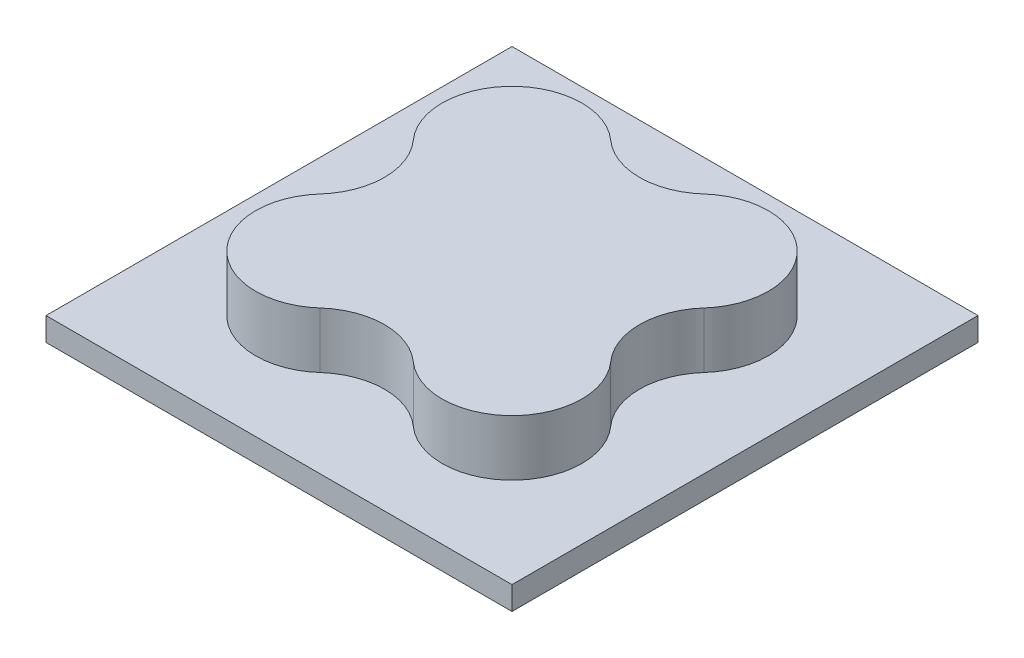
ISO-10303-21;
HEADER;
FILE_DESCRIPTION(('STEP AP214'),'2;1');
FILE_NAME('part.step','',(''),(''),'','','');
FILE_SCHEMA(('AUTOMOTIVE_DESIGN { 1 0 10303 214 1 1 1 1 }'));
ENDSEC;
DATA;
#1=APPLICATION_CONTEXT('core data for automotive mechanical design processes');
#2=APPLICATION_PROTOCOL_DEFINITION('international standard','automotive_design',2000,#1);
#3=PRODUCT_CONTEXT('',#1,'mechanical');
#4=PRODUCT('Part','Part','',(#3));
#5=PRODUCT_RELATED_PRODUCT_CATEGORY('part','',(#4));
#6=PRODUCT_DEFINITION_FORMATION('','',#4);
#7=PRODUCT_DEFINITION_CONTEXT('part definition',#1,'design');
#8=PRODUCT_DEFINITION('design','',#6,#7);
#9=PRODUCT_DEFINITION_SHAPE('','',#8);
#10=(LENGTH_UNIT() NAMED_UNIT(*) SI_UNIT(.MILLI.,.METRE.));
#11=(NAMED_UNIT(*) PLANE_ANGLE_UNIT() SI_UNIT($,.RADIAN.));
#12=(NAMED_UNIT(*) SI_UNIT($,.STERADIAN.) SOLID_ANGLE_UNIT());
#13=UNCERTAINTY_MEASURE_WITH_UNIT(LENGTH_MEASURE(1.E-05),#10,'distance_accuracy_value','');
#14=(GEOMETRIC_REPRESENTATION_CONTEXT(3) GLOBAL_UNCERTAINTY_ASSIGNED_CONTEXT((#13)) GLOBAL_UNIT_ASSIGNED_CONTEXT((#10,
#11,#12)) REPRESENTATION_CONTEXT('',''));
#15=CARTESIAN_POINT('',(0.,0.,0.));
#16=DIRECTION('',(0.,0.,1.));
#17=DIRECTION('',(1.,0.,0.));
#18=AXIS2_PLACEMENT_3D('',#15,#16,#17);
#19=CARTESIAN_POINT('',(0.,5.,0.));
#20=DIRECTION('',(1.,0.,0.));
#21=DIRECTION('',(0.,0.,-1.));
#22=AXIS2_PLACEMENT_3D('',#19,#20,#21);
#23=PLANE('',#22);
#24=DIRECTION('',(0.,0.,1.));
#25=VECTOR('',#24,1.);
#26=CARTESIAN_POINT('',(0.,0.,0.));
#27=LINE('',#26,#25);
#28=CARTESIAN_POINT('',(0.,0.,-100.));
#29=VERTEX_POINT('',#28);
#30=CARTESIAN_POINT('',(0.,0.,0.));
#31=VERTEX_POINT('',#30);
#32=EDGE_CURVE('E156',#29,#31,#27,.T.);
#33=ORIENTED_EDGE('',*,*,#32,.T.);
#34=DIRECTION('',(0.,-1.,0.));
#35=VECTOR('',#34,1.);
#36=CARTESIAN_POINT('',(0.,5.,0.));
#37=LINE('',#36,#35);
#38=CARTESIAN_POINT('',(0.,5.,0.));
#39=VERTEX_POINT('',#38);
#40=EDGE_CURVE('E11',#39,#31,#37,.T.);
#41=ORIENTED_EDGE('',*,*,#40,.F.);
#42=DIRECTION('',(0.,0.,1.));
#43=VECTOR('',#42,1.);
#44=CARTESIAN_POINT('',(0.,5.,0.));
#45=LINE('',#44,#43);
#46=CARTESIAN_POINT('',(0.,5.,-100.));
#47=VERTEX_POINT('',#46);
#48=EDGE_CURVE('E167',#47,#39,#45,.T.);
#49=ORIENTED_EDGE('',*,*,#48,.F.);
#50=DIRECTION('',(0.,-1.,0.));
#51=VECTOR('',#50,1.);
#52=CARTESIAN_POINT('',(0.,5.,-100.));
#53=LINE('',#52,#51);
#54=EDGE_CURVE('E180',#47,#29,#53,.T.);
#55=ORIENTED_EDGE('',*,*,#54,.T.);
#56=EDGE_LOOP('',(#33,#41,#49,#55));
#57=FACE_BOUND('',#56,.T.);
#58=ADVANCED_FACE('F44',(#57),#23,.F.);
#59=CARTESIAN_POINT('',(0.,5.,0.));
#60=DIRECTION('',(0.,0.,-1.));
#61=DIRECTION('',(-1.,0.,0.));
#62=AXIS2_PLACEMENT_3D('',#59,#60,#61);
#63=PLANE('',#62);
#64=DIRECTION('',(1.,0.,0.));
#65=VECTOR('',#64,1.);
#66=CARTESIAN_POINT('',(0.,0.,0.));
#67=LINE('',#66,#65);
#68=CARTESIAN_POINT('',(100.,0.,0.));
#69=VERTEX_POINT('',#68);
#70=EDGE_CURVE('E161',#31,#69,#67,.T.);
#71=ORIENTED_EDGE('',*,*,#70,.T.);
#72=DIRECTION('',(0.,-1.,0.));
#73=VECTOR('',#72,1.);
#74=CARTESIAN_POINT('',(100.,5.,0.));
#75=LINE('',#74,#73);
#76=CARTESIAN_POINT('',(100.,5.,0.));
#77=VERTEX_POINT('',#76);
#78=EDGE_CURVE('E52',#77,#69,#75,.T.);
#79=ORIENTED_EDGE('',*,*,#78,.F.);
#80=DIRECTION('',(1.,0.,0.));
#81=VECTOR('',#80,1.);
#82=CARTESIAN_POINT('',(0.,5.,0.));
#83=LINE('',#82,#81);
#84=EDGE_CURVE('E171',#39,#77,#83,.T.);
#85=ORIENTED_EDGE('',*,*,#84,.F.);
#86=ORIENTED_EDGE('',*,*,#40,.T.);
#87=EDGE_LOOP('',(#71,#79,#85,#86));
#88=FACE_BOUND('',#87,.T.);
#89=ADVANCED_FACE('F217',(#88),#63,.F.);
#90=CARTESIAN_POINT('',(100.,5.,0.));
#91=DIRECTION('',(-1.,0.,0.));
#92=DIRECTION('',(0.,0.,1.));
#93=AXIS2_PLACEMENT_3D('',#90,#91,#92);
#94=PLANE('',#93);
#95=DIRECTION('',(0.,0.,-1.));
#96=VECTOR('',#95,1.);
#97=CARTESIAN_POINT('',(100.,0.,0.));
#98=LINE('',#97,#96);
#99=CARTESIAN_POINT('',(100.,0.,-100.));
#100=VERTEX_POINT('',#99);
#101=EDGE_CURVE('E184',#69,#100,#98,.T.);
#102=ORIENTED_EDGE('',*,*,#101,.T.);
#103=DIRECTION('',(0.,-1.,0.));
#104=VECTOR('',#103,1.);
#105=CARTESIAN_POINT('',(100.,5.,-100.));
#106=LINE('',#105,#104);
#107=CARTESIAN_POINT('',(100.,5.,-100.));
#108=VERTEX_POINT('',#107);
#109=EDGE_CURVE('E192',#108,#100,#106,.T.);
#110=ORIENTED_EDGE('',*,*,#109,.F.);
#111=DIRECTION('',(0.,0.,-1.));
#112=VECTOR('',#111,1.);
#113=CARTESIAN_POINT('',(100.,5.,0.));
#114=LINE('',#113,#112);
#115=EDGE_CURVE('E175',#77,#108,#114,.T.);
#116=ORIENTED_EDGE('',*,*,#115,.F.);
#117=ORIENTED_EDGE('',*,*,#78,.T.);
#118=EDGE_LOOP('',(#102,#110,#116,#117));
#119=FACE_BOUND('',#118,.T.);
#120=ADVANCED_FACE('F201',(#119),#94,.F.);
#121=CARTESIAN_POINT('',(0.,5.,-100.));
#122=DIRECTION('',(0.,0.,1.));
#123=DIRECTION('',(1.,0.,0.));
#124=AXIS2_PLACEMENT_3D('',#121,#122,#123);
#125=PLANE('',#124);
#126=DIRECTION('',(-1.,0.,0.));
#127=VECTOR('',#126,1.);
#128=CARTESIAN_POINT('',(0.,0.,-100.));
#129=LINE('',#128,#127);
#130=EDGE_CURVE('E172',#100,#29,#129,.T.);
#131=ORIENTED_EDGE('',*,*,#130,.T.);
#132=ORIENTED_EDGE('',*,*,#54,.F.);
#133=DIRECTION('',(-1.,0.,0.));
#134=VECTOR('',#133,1.);
#135=CARTESIAN_POINT('',(0.,5.,-100.));
#136=LINE('',#135,#134);
#137=EDGE_CURVE('E178',#108,#47,#136,.T.);
#138=ORIENTED_EDGE('',*,*,#137,.F.);
#139=ORIENTED_EDGE('',*,*,#109,.T.);
#140=EDGE_LOOP('',(#131,#132,#138,#139));
#141=FACE_BOUND('',#140,.T.);
#142=ADVANCED_FACE('F210',(#141),#125,.F.);
#143=CARTESIAN_POINT('',(0.,5.,0.));
#144=DIRECTION('',(0.,-1.,0.));
#145=DIRECTION('',(0.,0.,-1.));
#146=AXIS2_PLACEMENT_3D('',#143,#144,#145);
#147=PLANE('',#146);
#148=CARTESIAN_POINT('',(50.,5.,-7.63932022500211));
#149=DIRECTION('',(0.,-1.,0.));
#150=DIRECTION('',(0.,0.,1.));
#151=AXIS2_PLACEMENT_3D('',#148,#149,#150);
#152=CIRCLE('',#151,15.);
#153=CARTESIAN_POINT('',(40.,5.,-18.8196601125011));
#154=VERTEX_POINT('',#153);
#155=CARTESIAN_POINT('',(60.,5.,-18.8196601125011));
#156=VERTEX_POINT('',#155);
#157=EDGE_CURVE('E59',#154,#156,#152,.T.);
#158=ORIENTED_EDGE('',*,*,#157,.F.);
#159=CARTESIAN_POINT('',(30.,5.,-30.));
#160=DIRECTION('',(0.,1.,0.));
#161=DIRECTION('',(0.,0.,1.));
#162=AXIS2_PLACEMENT_3D('',#159,#160,#161);
#163=CIRCLE('',#162,15.);
#164=CARTESIAN_POINT('',(18.819660112501,5.,-40.));
#165=VERTEX_POINT('',#164);
#166=EDGE_CURVE('E63',#165,#154,#163,.T.);
#167=ORIENTED_EDGE('',*,*,#166,.F.);
#168=CARTESIAN_POINT('',(7.63932022500209,5.,-50.));
#169=DIRECTION('',(0.,-1.,0.));
#170=DIRECTION('',(0.,0.,1.));
#171=AXIS2_PLACEMENT_3D('',#168,#169,#170);
#172=CIRCLE('',#171,15.);
#173=CARTESIAN_POINT('',(18.819660112501,5.,-60.));
#174=VERTEX_POINT('',#173);
#175=EDGE_CURVE('E383',#174,#165,#172,.T.);
#176=ORIENTED_EDGE('',*,*,#175,.F.);
#177=CARTESIAN_POINT('',(30.,5.,-70.));
#178=DIRECTION('',(0.,1.,0.));
#179=DIRECTION('',(0.,0.,1.));
#180=AXIS2_PLACEMENT_3D('',#177,#178,#179);
#181=CIRCLE('',#180,15.);
#182=CARTESIAN_POINT('',(40.,5.,-81.180339887499));
#183=VERTEX_POINT('',#182);
#184=EDGE_CURVE('E428',#183,#174,#181,.T.);
#185=ORIENTED_EDGE('',*,*,#184,.F.);
#186=CARTESIAN_POINT('',(50.,5.,-92.3606797749979));
#187=DIRECTION('',(0.,-1.,0.));
#188=DIRECTION('',(0.,0.,1.));
#189=AXIS2_PLACEMENT_3D('',#186,#187,#188);
#190=CIRCLE('',#189,15.);
#191=CARTESIAN_POINT('',(60.0000000000001,5.,-81.180339887499));
#192=VERTEX_POINT('',#191);
#193=EDGE_CURVE('E420',#192,#183,#190,.T.);
#194=ORIENTED_EDGE('',*,*,#193,.F.);
#195=CARTESIAN_POINT('',(70.0000000000001,5.,-70.0000000000001));
#196=DIRECTION('',(0.,1.,0.));
#197=DIRECTION('',(0.,0.,1.));
#198=AXIS2_PLACEMENT_3D('',#195,#196,#197);
#199=CIRCLE('',#198,15.);
#200=CARTESIAN_POINT('',(81.180339887499,5.,-60.0000000000001));
#201=VERTEX_POINT('',#200);
#202=EDGE_CURVE('E411',#201,#192,#199,.T.);
#203=ORIENTED_EDGE('',*,*,#202,.F.);
#204=CARTESIAN_POINT('',(92.3606797749979,5.,-50.));
#205=DIRECTION('',(0.,-1.,0.));
#206=DIRECTION('',(0.,0.,1.));
#207=AXIS2_PLACEMENT_3D('',#204,#205,#206);
#208=CIRCLE('',#207,15.);
#209=CARTESIAN_POINT('',(81.180339887499,5.,-40.));
#210=VERTEX_POINT('',#209);
#211=EDGE_CURVE('E414',#210,#201,#208,.T.);
#212=ORIENTED_EDGE('',*,*,#211,.F.);
#213=CARTESIAN_POINT('',(70.,5.,-30.));
#214=DIRECTION('',(0.,1.,0.));
#215=DIRECTION('',(0.,0.,1.));
#216=AXIS2_PLACEMENT_3D('',#213,#214,#215);
#217=CIRCLE('',#216,15.);
#218=EDGE_CURVE('E416',#156,#210,#217,.T.);
#219=ORIENTED_EDGE('',*,*,#218,.F.);
#220=EDGE_LOOP('',(#158,#167,#176,#185,#194,#203,#212,#219));
#221=FACE_BOUND('',#220,.T.);
#222=ORIENTED_EDGE('',*,*,#48,.T.);
#223=ORIENTED_EDGE('',*,*,#84,.T.);
#224=ORIENTED_EDGE('',*,*,#115,.T.);
#225=ORIENTED_EDGE('',*,*,#137,.T.);
#226=EDGE_LOOP('',(#222,#223,#224,#225));
#227=FACE_BOUND('',#226,.T.);
#228=ADVANCED_FACE('F216',(#221,#227),#147,.F.);
#229=CARTESIAN_POINT('',(0.,0.,0.));
#230=DIRECTION('',(0.,-1.,0.));
#231=DIRECTION('',(0.,0.,-1.));
#232=AXIS2_PLACEMENT_3D('',#229,#230,#231);
#233=PLANE('',#232);
#234=ORIENTED_EDGE('',*,*,#32,.F.);
#235=ORIENTED_EDGE('',*,*,#130,.F.);
#236=ORIENTED_EDGE('',*,*,#101,.F.);
#237=ORIENTED_EDGE('',*,*,#70,.F.);
#238=EDGE_LOOP('',(#234,#235,#236,#237));
#239=FACE_BOUND('',#238,.T.);
#240=ADVANCED_FACE('F207',(#239),#233,.T.);
#241=CARTESIAN_POINT('',(50.,17.,-7.63932022500211));
#242=DIRECTION('',(0.,-1.,0.));
#243=DIRECTION('',(0.,0.,-1.));
#244=AXIS2_PLACEMENT_3D('',#241,#242,#243);
#245=CYLINDRICAL_SURFACE('',#244,15.);
#246=ORIENTED_EDGE('',*,*,#157,.T.);
#247=DIRECTION('',(0.,-1.,0.));
#248=VECTOR('',#247,1.);
#249=CARTESIAN_POINT('',(60.,17.,-18.8196601125011));
#250=LINE('',#249,#248);
#251=CARTESIAN_POINT('',(60.,17.,-18.8196601125011));
#252=VERTEX_POINT('',#251);
#253=EDGE_CURVE('E136',#252,#156,#250,.T.);
#254=ORIENTED_EDGE('',*,*,#253,.F.);
#255=CARTESIAN_POINT('',(50.,17.,-7.63932022500211));
#256=DIRECTION('',(0.,-1.,0.));
#257=DIRECTION('',(0.,0.,1.));
#258=AXIS2_PLACEMENT_3D('',#255,#256,#257);
#259=CIRCLE('',#258,15.);
#260=CARTESIAN_POINT('',(40.,17.,-18.8196601125011));
#261=VERTEX_POINT('',#260);
#262=EDGE_CURVE('E143',#261,#252,#259,.T.);
#263=ORIENTED_EDGE('',*,*,#262,.F.);
#264=DIRECTION('',(0.,-1.,0.));
#265=VECTOR('',#264,1.);
#266=CARTESIAN_POINT('',(40.,17.,-18.8196601125011));
#267=LINE('',#266,#265);
#268=EDGE_CURVE('E379',#261,#154,#267,.T.);
#269=ORIENTED_EDGE('',*,*,#268,.T.);
#270=EDGE_LOOP('',(#246,#254,#263,#269));
#271=FACE_BOUND('',#270,.T.);
#272=ADVANCED_FACE('F154',(#271),#245,.F.);
#273=CARTESIAN_POINT('',(70.,17.,-30.));
#274=DIRECTION('',(0.,-1.,0.));
#275=DIRECTION('',(0.,0.,-1.));
#276=AXIS2_PLACEMENT_3D('',#273,#274,#275);
#277=CYLINDRICAL_SURFACE('',#276,15.);
#278=ORIENTED_EDGE('',*,*,#218,.T.);
#279=DIRECTION('',(0.,-1.,0.));
#280=VECTOR('',#279,1.);
#281=CARTESIAN_POINT('',(81.180339887499,17.,-40.));
#282=LINE('',#281,#280);
#283=CARTESIAN_POINT('',(81.180339887499,17.,-40.));
#284=VERTEX_POINT('',#283);
#285=EDGE_CURVE('E138',#284,#210,#282,.T.);
#286=ORIENTED_EDGE('',*,*,#285,.F.);
#287=CARTESIAN_POINT('',(70.,17.,-30.));
#288=DIRECTION('',(0.,1.,0.));
#289=DIRECTION('',(0.,0.,1.));
#290=AXIS2_PLACEMENT_3D('',#287,#288,#289);
#291=CIRCLE('',#290,15.);
#292=EDGE_CURVE('E131',#252,#284,#291,.T.);
#293=ORIENTED_EDGE('',*,*,#292,.F.);
#294=ORIENTED_EDGE('',*,*,#253,.T.);
#295=EDGE_LOOP('',(#278,#286,#293,#294));
#296=FACE_BOUND('',#295,.T.);
#297=ADVANCED_FACE('F134',(#296),#277,.T.);
#298=CARTESIAN_POINT('',(92.3606797749979,17.,-50.));
#299=DIRECTION('',(0.,-1.,0.));
#300=DIRECTION('',(0.,0.,-1.));
#301=AXIS2_PLACEMENT_3D('',#298,#299,#300);
#302=CYLINDRICAL_SURFACE('',#301,15.);
#303=ORIENTED_EDGE('',*,*,#211,.T.);
#304=DIRECTION('',(0.,-1.,0.));
#305=VECTOR('',#304,1.);
#306=CARTESIAN_POINT('',(81.180339887499,17.,-60.0000000000001));
#307=LINE('',#306,#305);
#308=CARTESIAN_POINT('',(81.180339887499,17.,-60.0000000000001));
#309=VERTEX_POINT('',#308);
#310=EDGE_CURVE('E163',#309,#201,#307,.T.);
#311=ORIENTED_EDGE('',*,*,#310,.F.);
#312=CARTESIAN_POINT('',(92.3606797749979,17.,-50.));
#313=DIRECTION('',(0.,-1.,0.));
#314=DIRECTION('',(0.,0.,1.));
#315=AXIS2_PLACEMENT_3D('',#312,#313,#314);
#316=CIRCLE('',#315,15.);
#317=EDGE_CURVE('E142',#284,#309,#316,.T.);
#318=ORIENTED_EDGE('',*,*,#317,.F.);
#319=ORIENTED_EDGE('',*,*,#285,.T.);
#320=EDGE_LOOP('',(#303,#311,#318,#319));
#321=FACE_BOUND('',#320,.T.);
#322=ADVANCED_FACE('F235',(#321),#302,.F.);
#323=CARTESIAN_POINT('',(70.0000000000001,17.,-70.0000000000001));
#324=DIRECTION('',(0.,-1.,0.));
#325=DIRECTION('',(0.,0.,-1.));
#326=AXIS2_PLACEMENT_3D('',#323,#324,#325);
#327=CYLINDRICAL_SURFACE('',#326,15.);
#328=ORIENTED_EDGE('',*,*,#202,.T.);
#329=DIRECTION('',(0.,-1.,0.));
#330=VECTOR('',#329,1.);
#331=CARTESIAN_POINT('',(60.0000000000001,17.,-81.180339887499));
#332=LINE('',#331,#330);
#333=CARTESIAN_POINT('',(60.0000000000001,17.,-81.180339887499));
#334=VERTEX_POINT('',#333);
#335=EDGE_CURVE('E402',#334,#192,#332,.T.);
#336=ORIENTED_EDGE('',*,*,#335,.F.);
#337=CARTESIAN_POINT('',(70.0000000000001,17.,-70.0000000000001));
#338=DIRECTION('',(0.,1.,0.));
#339=DIRECTION('',(0.,0.,1.));
#340=AXIS2_PLACEMENT_3D('',#337,#338,#339);
#341=CIRCLE('',#340,15.);
#342=EDGE_CURVE('E412',#309,#334,#341,.T.);
#343=ORIENTED_EDGE('',*,*,#342,.F.);
#344=ORIENTED_EDGE('',*,*,#310,.T.);
#345=EDGE_LOOP('',(#328,#336,#343,#344));
#346=FACE_BOUND('',#345,.T.);
#347=ADVANCED_FACE('F238',(#346),#327,.T.);
#348=CARTESIAN_POINT('',(50.,17.,-92.3606797749979));
#349=DIRECTION('',(0.,-1.,0.));
#350=DIRECTION('',(0.,0.,-1.));
#351=AXIS2_PLACEMENT_3D('',#348,#349,#350);
#352=CYLINDRICAL_SURFACE('',#351,15.);
#353=ORIENTED_EDGE('',*,*,#193,.T.);
#354=DIRECTION('',(0.,-1.,0.));
#355=VECTOR('',#354,1.);
#356=CARTESIAN_POINT('',(40.,17.,-81.180339887499));
#357=LINE('',#356,#355);
#358=CARTESIAN_POINT('',(40.,17.,-81.180339887499));
#359=VERTEX_POINT('',#358);
#360=EDGE_CURVE('E398',#359,#183,#357,.T.);
#361=ORIENTED_EDGE('',*,*,#360,.F.);
#362=CARTESIAN_POINT('',(50.,17.,-92.3606797749979));
#363=DIRECTION('',(0.,-1.,0.));
#364=DIRECTION('',(0.,0.,1.));
#365=AXIS2_PLACEMENT_3D('',#362,#363,#364);
#366=CIRCLE('',#365,15.);
#367=EDGE_CURVE('E438',#334,#359,#366,.T.);
#368=ORIENTED_EDGE('',*,*,#367,.F.);
#369=ORIENTED_EDGE('',*,*,#335,.T.);
#370=EDGE_LOOP('',(#353,#361,#368,#369));
#371=FACE_BOUND('',#370,.T.);
#372=ADVANCED_FACE('F242',(#371),#352,.F.);
#373=CARTESIAN_POINT('',(30.,17.,-70.));
#374=DIRECTION('',(0.,-1.,0.));
#375=DIRECTION('',(0.,0.,-1.));
#376=AXIS2_PLACEMENT_3D('',#373,#374,#375);
#377=CYLINDRICAL_SURFACE('',#376,15.);
#378=ORIENTED_EDGE('',*,*,#184,.T.);
#379=DIRECTION('',(0.,-1.,0.));
#380=VECTOR('',#379,1.);
#381=CARTESIAN_POINT('',(18.819660112501,17.,-60.));
#382=LINE('',#381,#380);
#383=CARTESIAN_POINT('',(18.819660112501,17.,-60.));
#384=VERTEX_POINT('',#383);
#385=EDGE_CURVE('E389',#384,#174,#382,.T.);
#386=ORIENTED_EDGE('',*,*,#385,.F.);
#387=CARTESIAN_POINT('',(30.,17.,-70.));
#388=DIRECTION('',(0.,1.,0.));
#389=DIRECTION('',(0.,0.,1.));
#390=AXIS2_PLACEMENT_3D('',#387,#388,#389);
#391=CIRCLE('',#390,15.);
#392=EDGE_CURVE('E436',#359,#384,#391,.T.);
#393=ORIENTED_EDGE('',*,*,#392,.F.);
#394=ORIENTED_EDGE('',*,*,#360,.T.);
#395=EDGE_LOOP('',(#378,#386,#393,#394));
#396=FACE_BOUND('',#395,.T.);
#397=ADVANCED_FACE('F246',(#396),#377,.T.);
#398=CARTESIAN_POINT('',(7.63932022500209,17.,-50.));
#399=DIRECTION('',(0.,-1.,0.));
#400=DIRECTION('',(0.,0.,-1.));
#401=AXIS2_PLACEMENT_3D('',#398,#399,#400);
#402=CYLINDRICAL_SURFACE('',#401,15.);
#403=ORIENTED_EDGE('',*,*,#175,.T.);
#404=DIRECTION('',(0.,-1.,0.));
#405=VECTOR('',#404,1.);
#406=CARTESIAN_POINT('',(18.819660112501,17.,-40.));
#407=LINE('',#406,#405);
#408=CARTESIAN_POINT('',(18.819660112501,17.,-40.));
#409=VERTEX_POINT('',#408);
#410=EDGE_CURVE('E381',#409,#165,#407,.T.);
#411=ORIENTED_EDGE('',*,*,#410,.F.);
#412=CARTESIAN_POINT('',(7.63932022500209,17.,-50.));
#413=DIRECTION('',(0.,-1.,0.));
#414=DIRECTION('',(0.,0.,1.));
#415=AXIS2_PLACEMENT_3D('',#412,#413,#414);
#416=CIRCLE('',#415,15.);
#417=EDGE_CURVE('E391',#384,#409,#416,.T.);
#418=ORIENTED_EDGE('',*,*,#417,.F.);
#419=ORIENTED_EDGE('',*,*,#385,.T.);
#420=EDGE_LOOP('',(#403,#411,#418,#419));
#421=FACE_BOUND('',#420,.T.);
#422=ADVANCED_FACE('F250',(#421),#402,.F.);
#423=CARTESIAN_POINT('',(30.,17.,-30.));
#424=DIRECTION('',(0.,-1.,0.));
#425=DIRECTION('',(0.,0.,-1.));
#426=AXIS2_PLACEMENT_3D('',#423,#424,#425);
#427=CYLINDRICAL_SURFACE('',#426,15.);
#428=ORIENTED_EDGE('',*,*,#166,.T.);
#429=ORIENTED_EDGE('',*,*,#268,.F.);
#430=CARTESIAN_POINT('',(30.,17.,-30.));
#431=DIRECTION('',(0.,1.,0.));
#432=DIRECTION('',(0.,0.,1.));
#433=AXIS2_PLACEMENT_3D('',#430,#431,#432);
#434=CIRCLE('',#433,15.);
#435=EDGE_CURVE('E148',#409,#261,#434,.T.);
#436=ORIENTED_EDGE('',*,*,#435,.F.);
#437=ORIENTED_EDGE('',*,*,#410,.T.);
#438=EDGE_LOOP('',(#428,#429,#436,#437));
#439=FACE_BOUND('',#438,.T.);
#440=ADVANCED_FACE('F254',(#439),#427,.T.);
#441=CARTESIAN_POINT('',(40.,17.,-18.8196601125011));
#442=DIRECTION('',(0.,1.,0.));
#443=DIRECTION('',(0.,0.,1.));
#444=AXIS2_PLACEMENT_3D('',#441,#442,#443);
#445=PLANE('',#444);
#446=ORIENTED_EDGE('',*,*,#262,.T.);
#447=ORIENTED_EDGE('',*,*,#292,.T.);
#448=ORIENTED_EDGE('',*,*,#317,.T.);
#449=ORIENTED_EDGE('',*,*,#342,.T.);
#450=ORIENTED_EDGE('',*,*,#367,.T.);
#451=ORIENTED_EDGE('',*,*,#392,.T.);
#452=ORIENTED_EDGE('',*,*,#417,.T.);
#453=ORIENTED_EDGE('',*,*,#435,.T.);
#454=EDGE_LOOP('',(#446,#447,#448,#449,#450,#451,#452,#453));
#455=FACE_BOUND('',#454,.T.);
#456=ADVANCED_FACE('F146',(#455),#445,.T.);
#457=CLOSED_SHELL('',(#58,#89,#120,#142,#228,#240,#272,#297,#322,#347,#372,#397,#422,#440,#456));
#458=MANIFOLD_SOLID_BREP('B2',#457);
#459=ADVANCED_BREP_SHAPE_REPRESENTATION('',(#18,#458),#14);
#460=SHAPE_DEFINITION_REPRESENTATION(#9,#459);
ENDSEC;
END-ISO-10303-21;
